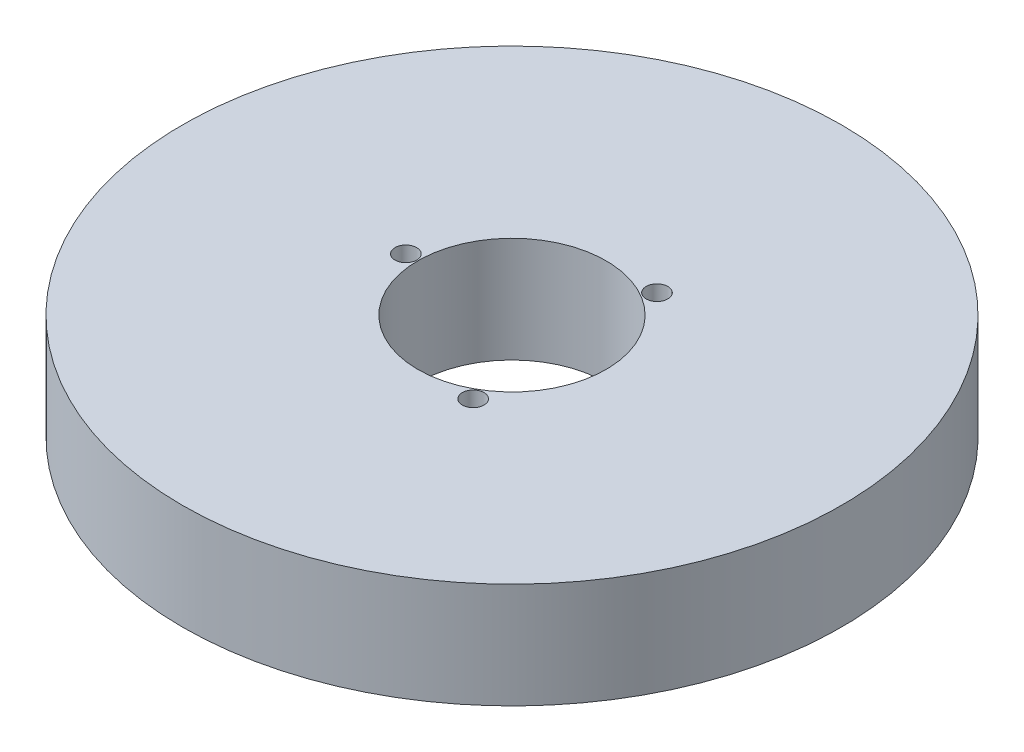
ISO-10303-21;
HEADER;
FILE_DESCRIPTION(('STEP AP214'),'2;1');
FILE_NAME('part.step','',(''),(''),'','','');
FILE_SCHEMA(('AUTOMOTIVE_DESIGN { 1 0 10303 214 1 1 1 1 }'));
ENDSEC;
DATA;
#1=APPLICATION_CONTEXT('core data for automotive mechanical design processes');
#2=APPLICATION_PROTOCOL_DEFINITION('international standard','automotive_design',2000,#1);
#3=PRODUCT_CONTEXT('',#1,'mechanical');
#4=PRODUCT('Part','Part','',(#3));
#5=PRODUCT_RELATED_PRODUCT_CATEGORY('part','',(#4));
#6=PRODUCT_DEFINITION_FORMATION('','',#4);
#7=PRODUCT_DEFINITION_CONTEXT('part definition',#1,'design');
#8=PRODUCT_DEFINITION('design','',#6,#7);
#9=PRODUCT_DEFINITION_SHAPE('','',#8);
#10=(LENGTH_UNIT() NAMED_UNIT(*) SI_UNIT(.MILLI.,.METRE.));
#11=(NAMED_UNIT(*) PLANE_ANGLE_UNIT() SI_UNIT($,.RADIAN.));
#12=(NAMED_UNIT(*) SI_UNIT($,.STERADIAN.) SOLID_ANGLE_UNIT());
#13=UNCERTAINTY_MEASURE_WITH_UNIT(LENGTH_MEASURE(1.E-05),#10,'distance_accuracy_value','');
#14=(GEOMETRIC_REPRESENTATION_CONTEXT(3) GLOBAL_UNCERTAINTY_ASSIGNED_CONTEXT((#13)) GLOBAL_UNIT_ASSIGNED_CONTEXT((#10,
#11,#12)) REPRESENTATION_CONTEXT('',''));
#15=CARTESIAN_POINT('',(0.,0.,0.));
#16=DIRECTION('',(0.,0.,1.));
#17=DIRECTION('',(1.,0.,0.));
#18=AXIS2_PLACEMENT_3D('',#15,#16,#17);
#19=CARTESIAN_POINT('',(0.,28.,0.));
#20=DIRECTION('',(0.,-1.,0.));
#21=DIRECTION('',(0.,0.,-1.));
#22=AXIS2_PLACEMENT_3D('',#19,#20,#21);
#23=CYLINDRICAL_SURFACE('',#22,87.5);
#24=CARTESIAN_POINT('',(0.,28.,0.));
#25=DIRECTION('',(0.,1.,0.));
#26=DIRECTION('',(0.,0.,1.));
#27=AXIS2_PLACEMENT_3D('',#24,#25,#26);
#28=CIRCLE('',#27,87.5);
#29=CARTESIAN_POINT('',(0.,28.,87.5));
#30=VERTEX_POINT('',#29);
#31=EDGE_CURVE('E10',#30,#30,#28,.T.);
#32=ORIENTED_EDGE('',*,*,#31,.F.);
#33=EDGE_LOOP('',(#32));
#34=FACE_BOUND('',#33,.T.);
#35=CARTESIAN_POINT('',(0.,0.,0.));
#36=DIRECTION('',(0.,1.,0.));
#37=DIRECTION('',(0.,0.,1.));
#38=AXIS2_PLACEMENT_3D('',#35,#36,#37);
#39=CIRCLE('',#38,87.5);
#40=CARTESIAN_POINT('',(0.,0.,87.5));
#41=VERTEX_POINT('',#40);
#42=EDGE_CURVE('E37',#41,#41,#39,.T.);
#43=ORIENTED_EDGE('',*,*,#42,.T.);
#44=EDGE_LOOP('',(#43));
#45=FACE_BOUND('',#44,.T.);
#46=ADVANCED_FACE('F40',(#34,#45),#23,.T.);
#47=CARTESIAN_POINT('',(0.,28.,0.));
#48=DIRECTION('',(0.,1.,0.));
#49=DIRECTION('',(0.,0.,1.));
#50=AXIS2_PLACEMENT_3D('',#47,#48,#49);
#51=PLANE('',#50);
#52=CARTESIAN_POINT('',(14.0892248459351,28.,24.4032532724211));
#53=DIRECTION('',(0.,1.,0.));
#54=DIRECTION('',(0.866025403784436,0.,-0.500000000000004));
#55=AXIS2_PLACEMENT_3D('',#52,#53,#54);
#56=CIRCLE('',#55,2.87953197130539);
#57=CARTESIAN_POINT('',(16.5829726840951,28.,22.9634872867684));
#58=VERTEX_POINT('',#57);
#59=EDGE_CURVE('E70',#58,#58,#56,.T.);
#60=ORIENTED_EDGE('',*,*,#59,.F.);
#61=EDGE_LOOP('',(#60));
#62=FACE_BOUND('',#61,.T.);
#63=CARTESIAN_POINT('',(14.0892248459348,28.,-24.4032532724213));
#64=DIRECTION('',(0.,1.,0.));
#65=DIRECTION('',(-0.866025403784443,0.,-0.499999999999992));
#66=AXIS2_PLACEMENT_3D('',#63,#64,#65);
#67=CIRCLE('',#66,2.87953197130539);
#68=CARTESIAN_POINT('',(11.5954770077748,28.,-25.843019258074));
#69=VERTEX_POINT('',#68);
#70=EDGE_CURVE('E61',#69,#69,#67,.T.);
#71=ORIENTED_EDGE('',*,*,#70,.F.);
#72=EDGE_LOOP('',(#71));
#73=FACE_BOUND('',#72,.T.);
#74=CARTESIAN_POINT('',(-28.17844969187,28.,0.));
#75=DIRECTION('',(0.,1.,0.));
#76=DIRECTION('',(0.,0.,1.));
#77=AXIS2_PLACEMENT_3D('',#74,#75,#76);
#78=CIRCLE('',#77,2.87953197130539);
#79=CARTESIAN_POINT('',(-28.17844969187,28.,2.87953197130539));
#80=VERTEX_POINT('',#79);
#81=EDGE_CURVE('E54',#80,#80,#78,.T.);
#82=ORIENTED_EDGE('',*,*,#81,.F.);
#83=EDGE_LOOP('',(#82));
#84=FACE_BOUND('',#83,.T.);
#85=CARTESIAN_POINT('',(0.,28.,0.));
#86=DIRECTION('',(0.,1.,0.));
#87=DIRECTION('',(0.,0.,1.));
#88=AXIS2_PLACEMENT_3D('',#85,#86,#87);
#89=CIRCLE('',#88,25.);
#90=CARTESIAN_POINT('',(0.,28.,25.));
#91=VERTEX_POINT('',#90);
#92=EDGE_CURVE('E50',#91,#91,#89,.T.);
#93=ORIENTED_EDGE('',*,*,#92,.F.);
#94=EDGE_LOOP('',(#93));
#95=FACE_BOUND('',#94,.T.);
#96=ORIENTED_EDGE('',*,*,#31,.T.);
#97=EDGE_LOOP('',(#96));
#98=FACE_BOUND('',#97,.T.);
#99=ADVANCED_FACE('F85',(#62,#73,#84,#95,#98),#51,.T.);
#100=CARTESIAN_POINT('',(0.,0.,0.));
#101=DIRECTION('',(0.,1.,0.));
#102=DIRECTION('',(0.,0.,1.));
#103=AXIS2_PLACEMENT_3D('',#100,#101,#102);
#104=PLANE('',#103);
#105=CARTESIAN_POINT('',(0.,0.,0.));
#106=DIRECTION('',(0.,1.,0.));
#107=DIRECTION('',(0.,0.,1.));
#108=AXIS2_PLACEMENT_3D('',#105,#106,#107);
#109=CIRCLE('',#108,25.);
#110=CARTESIAN_POINT('',(0.,0.,25.));
#111=VERTEX_POINT('',#110);
#112=EDGE_CURVE('E47',#111,#111,#109,.T.);
#113=ORIENTED_EDGE('',*,*,#112,.T.);
#114=EDGE_LOOP('',(#113));
#115=FACE_BOUND('',#114,.T.);
#116=ORIENTED_EDGE('',*,*,#42,.F.);
#117=EDGE_LOOP('',(#116));
#118=FACE_BOUND('',#117,.T.);
#119=ADVANCED_FACE('F84',(#115,#118),#104,.F.);
#120=CARTESIAN_POINT('',(0.,28.,0.));
#121=DIRECTION('',(0.,-1.,0.));
#122=DIRECTION('',(0.,0.,-1.));
#123=AXIS2_PLACEMENT_3D('',#120,#121,#122);
#124=CYLINDRICAL_SURFACE('',#123,25.);
#125=ORIENTED_EDGE('',*,*,#92,.T.);
#126=EDGE_LOOP('',(#125));
#127=FACE_BOUND('',#126,.T.);
#128=ORIENTED_EDGE('',*,*,#112,.F.);
#129=EDGE_LOOP('',(#128));
#130=FACE_BOUND('',#129,.T.);
#131=ADVANCED_FACE('F91',(#127,#130),#124,.F.);
#132=CARTESIAN_POINT('',(-28.17844969187,2.64782199070895,0.));
#133=DIRECTION('',(0.,1.,0.));
#134=DIRECTION('',(0.,0.,1.));
#135=AXIS2_PLACEMENT_3D('',#132,#133,#134);
#136=CYLINDRICAL_SURFACE('',#135,2.87953197130539);
#137=CARTESIAN_POINT('',(-28.17844969187,2.64782199070895,0.));
#138=DIRECTION('',(0.,1.,0.));
#139=DIRECTION('',(0.,0.,1.));
#140=AXIS2_PLACEMENT_3D('',#137,#138,#139);
#141=CIRCLE('',#140,2.87953197130539);
#142=CARTESIAN_POINT('',(-28.17844969187,2.64782199070895,2.87953197130539));
#143=VERTEX_POINT('',#142);
#144=EDGE_CURVE('E55',#143,#143,#141,.T.);
#145=ORIENTED_EDGE('',*,*,#144,.F.);
#146=EDGE_LOOP('',(#145));
#147=FACE_BOUND('',#146,.T.);
#148=ORIENTED_EDGE('',*,*,#81,.T.);
#149=EDGE_LOOP('',(#148));
#150=FACE_BOUND('',#149,.T.);
#151=ADVANCED_FACE('F96',(#147,#150),#136,.F.);
#152=CARTESIAN_POINT('',(-28.17844969187,2.64782199070895,0.));
#153=DIRECTION('',(0.,1.,0.));
#154=DIRECTION('',(0.,0.,1.));
#155=AXIS2_PLACEMENT_3D('',#152,#153,#154);
#156=PLANE('',#155);
#157=ORIENTED_EDGE('',*,*,#144,.T.);
#158=EDGE_LOOP('',(#157));
#159=FACE_BOUND('',#158,.T.);
#160=ADVANCED_FACE('F127',(#159),#156,.T.);
#161=CARTESIAN_POINT('',(14.0892248459348,2.64782199070895,-24.4032532724213));
#162=DIRECTION('',(0.,1.,0.));
#163=DIRECTION('',(0.,0.,1.));
#164=AXIS2_PLACEMENT_3D('',#161,#162,#163);
#165=CYLINDRICAL_SURFACE('',#164,2.87953197130539);
#166=CARTESIAN_POINT('',(14.0892248459348,2.64782199070895,-24.4032532724213));
#167=DIRECTION('',(0.,1.,0.));
#168=DIRECTION('',(-0.866025403784443,0.,-0.499999999999992));
#169=AXIS2_PLACEMENT_3D('',#166,#167,#168);
#170=CIRCLE('',#169,2.87953197130539);
#171=CARTESIAN_POINT('',(11.5954770077748,2.64782199070895,-25.843019258074));
#172=VERTEX_POINT('',#171);
#173=EDGE_CURVE('E63',#172,#172,#170,.T.);
#174=ORIENTED_EDGE('',*,*,#173,.F.);
#175=EDGE_LOOP('',(#174));
#176=FACE_BOUND('',#175,.T.);
#177=ORIENTED_EDGE('',*,*,#70,.T.);
#178=EDGE_LOOP('',(#177));
#179=FACE_BOUND('',#178,.T.);
#180=ADVANCED_FACE('F133',(#176,#179),#165,.F.);
#181=CARTESIAN_POINT('',(14.0892248459348,2.64782199070895,-24.4032532724213));
#182=DIRECTION('',(0.,1.,0.));
#183=DIRECTION('',(-0.866025403784443,0.,-0.499999999999992));
#184=AXIS2_PLACEMENT_3D('',#181,#182,#183);
#185=PLANE('',#184);
#186=ORIENTED_EDGE('',*,*,#173,.T.);
#187=EDGE_LOOP('',(#186));
#188=FACE_BOUND('',#187,.T.);
#189=ADVANCED_FACE('F77',(#188),#185,.T.);
#190=CARTESIAN_POINT('',(14.0892248459351,2.64782199070895,24.4032532724211));
#191=DIRECTION('',(0.,1.,0.));
#192=DIRECTION('',(0.,0.,1.));
#193=AXIS2_PLACEMENT_3D('',#190,#191,#192);
#194=CYLINDRICAL_SURFACE('',#193,2.87953197130539);
#195=CARTESIAN_POINT('',(14.0892248459351,2.64782199070895,24.4032532724211));
#196=DIRECTION('',(0.,1.,0.));
#197=DIRECTION('',(0.866025403784436,0.,-0.500000000000004));
#198=AXIS2_PLACEMENT_3D('',#195,#196,#197);
#199=CIRCLE('',#198,2.87953197130539);
#200=CARTESIAN_POINT('',(16.5829726840951,2.64782199070895,22.9634872867684));
#201=VERTEX_POINT('',#200);
#202=EDGE_CURVE('E59',#201,#201,#199,.T.);
#203=ORIENTED_EDGE('',*,*,#202,.F.);
#204=EDGE_LOOP('',(#203));
#205=FACE_BOUND('',#204,.T.);
#206=ORIENTED_EDGE('',*,*,#59,.T.);
#207=EDGE_LOOP('',(#206));
#208=FACE_BOUND('',#207,.T.);
#209=ADVANCED_FACE('F73',(#205,#208),#194,.F.);
#210=CARTESIAN_POINT('',(14.0892248459351,2.64782199070895,24.4032532724211));
#211=DIRECTION('',(0.,1.,0.));
#212=DIRECTION('',(0.866025403784436,0.,-0.500000000000004));
#213=AXIS2_PLACEMENT_3D('',#210,#211,#212);
#214=PLANE('',#213);
#215=ORIENTED_EDGE('',*,*,#202,.T.);
#216=EDGE_LOOP('',(#215));
#217=FACE_BOUND('',#216,.T.);
#218=ADVANCED_FACE('F71',(#217),#214,.T.);
#219=CLOSED_SHELL('',(#46,#99,#119,#131,#151,#160,#180,#189,#209,#218));
#220=MANIFOLD_SOLID_BREP('B2',#219);
#221=ADVANCED_BREP_SHAPE_REPRESENTATION('',(#18,#220),#14);
#222=SHAPE_DEFINITION_REPRESENTATION(#9,#221);
ENDSEC;
END-ISO-10303-21;
